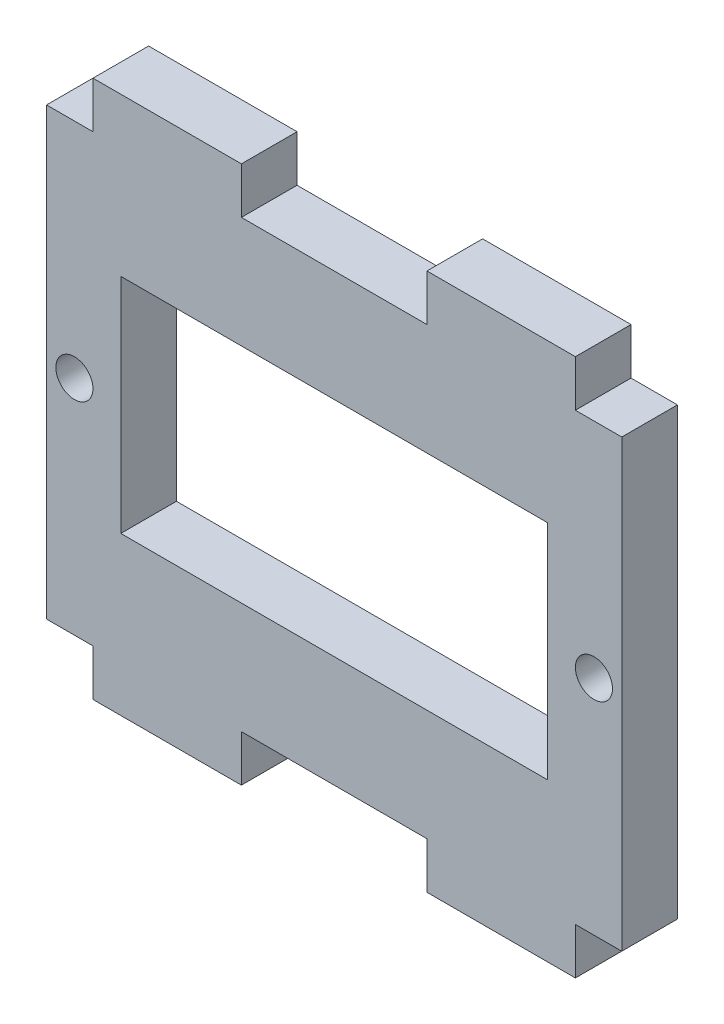
ISO-10303-21;
HEADER;
FILE_DESCRIPTION(('STEP AP214'),'2;1');
FILE_NAME('part.step','',(''),(''),'','','');
FILE_SCHEMA(('AUTOMOTIVE_DESIGN { 1 0 10303 214 1 1 1 1 }'));
ENDSEC;
DATA;
#1=APPLICATION_CONTEXT('core data for automotive mechanical design processes');
#2=APPLICATION_PROTOCOL_DEFINITION('international standard','automotive_design',2000,#1);
#3=PRODUCT_CONTEXT('',#1,'mechanical');
#4=PRODUCT('Part','Part','',(#3));
#5=PRODUCT_RELATED_PRODUCT_CATEGORY('part','',(#4));
#6=PRODUCT_DEFINITION_FORMATION('','',#4);
#7=PRODUCT_DEFINITION_CONTEXT('part definition',#1,'design');
#8=PRODUCT_DEFINITION('design','',#6,#7);
#9=PRODUCT_DEFINITION_SHAPE('','',#8);
#10=(LENGTH_UNIT() NAMED_UNIT(*) SI_UNIT(.MILLI.,.METRE.));
#11=(NAMED_UNIT(*) PLANE_ANGLE_UNIT() SI_UNIT($,.RADIAN.));
#12=(NAMED_UNIT(*) SI_UNIT($,.STERADIAN.) SOLID_ANGLE_UNIT());
#13=UNCERTAINTY_MEASURE_WITH_UNIT(LENGTH_MEASURE(1.E-05),#10,'distance_accuracy_value','');
#14=(GEOMETRIC_REPRESENTATION_CONTEXT(3) GLOBAL_UNCERTAINTY_ASSIGNED_CONTEXT((#13)) GLOBAL_UNIT_ASSIGNED_CONTEXT((#10,
#11,#12)) REPRESENTATION_CONTEXT('',''));
#15=CARTESIAN_POINT('',(0.,0.,0.));
#16=DIRECTION('',(0.,0.,1.));
#17=DIRECTION('',(1.,0.,0.));
#18=AXIS2_PLACEMENT_3D('',#15,#16,#17);
#19=CARTESIAN_POINT('',(15.5,0.,1.5));
#20=DIRECTION('',(1.,0.,0.));
#21=DIRECTION('',(0.,1.,0.));
#22=AXIS2_PLACEMENT_3D('',#19,#20,#21);
#23=PLANE('',#22);
#24=DIRECTION('',(0.,-1.,0.));
#25=VECTOR('',#24,1.);
#26=CARTESIAN_POINT('',(15.5,0.,-1.5));
#27=LINE('',#26,#25);
#28=CARTESIAN_POINT('',(15.5,12.,-1.5));
#29=VERTEX_POINT('',#28);
#30=CARTESIAN_POINT('',(15.5,-12.,-1.5));
#31=VERTEX_POINT('',#30);
#32=EDGE_CURVE('E254',#29,#31,#27,.T.);
#33=ORIENTED_EDGE('',*,*,#32,.F.);
#34=DIRECTION('',(0.,0.,-1.));
#35=VECTOR('',#34,1.);
#36=CARTESIAN_POINT('',(15.5,12.,1.5));
#37=LINE('',#36,#35);
#38=CARTESIAN_POINT('',(15.5,12.,1.5));
#39=VERTEX_POINT('',#38);
#40=EDGE_CURVE('E11',#39,#29,#37,.T.);
#41=ORIENTED_EDGE('',*,*,#40,.F.);
#42=DIRECTION('',(0.,-1.,0.));
#43=VECTOR('',#42,1.);
#44=CARTESIAN_POINT('',(15.5,0.,1.5));
#45=LINE('',#44,#43);
#46=CARTESIAN_POINT('',(15.5,-12.,1.5));
#47=VERTEX_POINT('',#46);
#48=EDGE_CURVE('E446',#39,#47,#45,.T.);
#49=ORIENTED_EDGE('',*,*,#48,.T.);
#50=DIRECTION('',(0.,0.,-1.));
#51=VECTOR('',#50,1.);
#52=CARTESIAN_POINT('',(15.5,-12.,1.5));
#53=LINE('',#52,#51);
#54=EDGE_CURVE('E137',#47,#31,#53,.T.);
#55=ORIENTED_EDGE('',*,*,#54,.T.);
#56=EDGE_LOOP('',(#33,#41,#49,#55));
#57=FACE_BOUND('',#56,.T.);
#58=ADVANCED_FACE('F35',(#57),#23,.T.);
#59=CARTESIAN_POINT('',(0.,12.,1.5));
#60=DIRECTION('',(0.,1.,0.));
#61=DIRECTION('',(0.,0.,1.));
#62=AXIS2_PLACEMENT_3D('',#59,#60,#61);
#63=PLANE('',#62);
#64=DIRECTION('',(1.,0.,0.));
#65=VECTOR('',#64,1.);
#66=CARTESIAN_POINT('',(0.,12.,-1.5));
#67=LINE('',#66,#65);
#68=CARTESIAN_POINT('',(13.,12.,-1.5));
#69=VERTEX_POINT('',#68);
#70=EDGE_CURVE('E256',#69,#29,#67,.T.);
#71=ORIENTED_EDGE('',*,*,#70,.F.);
#72=DIRECTION('',(0.,0.,-1.));
#73=VECTOR('',#72,1.);
#74=CARTESIAN_POINT('',(13.,12.,1.5));
#75=LINE('',#74,#73);
#76=CARTESIAN_POINT('',(13.,12.,1.5));
#77=VERTEX_POINT('',#76);
#78=EDGE_CURVE('E45',#77,#69,#75,.T.);
#79=ORIENTED_EDGE('',*,*,#78,.F.);
#80=DIRECTION('',(1.,0.,0.));
#81=VECTOR('',#80,1.);
#82=CARTESIAN_POINT('',(0.,12.,1.5));
#83=LINE('',#82,#81);
#84=EDGE_CURVE('E448',#77,#39,#83,.T.);
#85=ORIENTED_EDGE('',*,*,#84,.T.);
#86=ORIENTED_EDGE('',*,*,#40,.T.);
#87=EDGE_LOOP('',(#71,#79,#85,#86));
#88=FACE_BOUND('',#87,.T.);
#89=ADVANCED_FACE('F377',(#88),#63,.T.);
#90=CARTESIAN_POINT('',(13.,0.,1.5));
#91=DIRECTION('',(1.,0.,0.));
#92=DIRECTION('',(0.,1.,0.));
#93=AXIS2_PLACEMENT_3D('',#90,#91,#92);
#94=PLANE('',#93);
#95=DIRECTION('',(0.,-1.,0.));
#96=VECTOR('',#95,1.);
#97=CARTESIAN_POINT('',(13.,0.,-1.5));
#98=LINE('',#97,#96);
#99=CARTESIAN_POINT('',(13.,14.5,-1.5));
#100=VERTEX_POINT('',#99);
#101=EDGE_CURVE('E259',#100,#69,#98,.T.);
#102=ORIENTED_EDGE('',*,*,#101,.F.);
#103=DIRECTION('',(0.,0.,-1.));
#104=VECTOR('',#103,1.);
#105=CARTESIAN_POINT('',(13.,14.5,1.5));
#106=LINE('',#105,#104);
#107=CARTESIAN_POINT('',(13.,14.5,1.5));
#108=VERTEX_POINT('',#107);
#109=EDGE_CURVE('E341',#108,#100,#106,.T.);
#110=ORIENTED_EDGE('',*,*,#109,.F.);
#111=DIRECTION('',(0.,-1.,0.));
#112=VECTOR('',#111,1.);
#113=CARTESIAN_POINT('',(13.,0.,1.5));
#114=LINE('',#113,#112);
#115=EDGE_CURVE('E451',#108,#77,#114,.T.);
#116=ORIENTED_EDGE('',*,*,#115,.T.);
#117=ORIENTED_EDGE('',*,*,#78,.T.);
#118=EDGE_LOOP('',(#102,#110,#116,#117));
#119=FACE_BOUND('',#118,.T.);
#120=ADVANCED_FACE('F382',(#119),#94,.T.);
#121=CARTESIAN_POINT('',(0.,14.5,1.5));
#122=DIRECTION('',(0.,-1.,0.));
#123=DIRECTION('',(1.,0.,0.));
#124=AXIS2_PLACEMENT_3D('',#121,#122,#123);
#125=PLANE('',#124);
#126=DIRECTION('',(-1.,0.,0.));
#127=VECTOR('',#126,1.);
#128=CARTESIAN_POINT('',(0.,14.5,-1.5));
#129=LINE('',#128,#127);
#130=CARTESIAN_POINT('',(4.99999999999999,14.5,-1.5));
#131=VERTEX_POINT('',#130);
#132=EDGE_CURVE('E264',#100,#131,#129,.T.);
#133=ORIENTED_EDGE('',*,*,#132,.T.);
#134=DIRECTION('',(0.,0.,-1.));
#135=VECTOR('',#134,1.);
#136=CARTESIAN_POINT('',(4.99999999999999,14.5,1.5));
#137=LINE('',#136,#135);
#138=CARTESIAN_POINT('',(4.99999999999999,14.5,1.5));
#139=VERTEX_POINT('',#138);
#140=EDGE_CURVE('E338',#139,#131,#137,.T.);
#141=ORIENTED_EDGE('',*,*,#140,.F.);
#142=DIRECTION('',(-1.,0.,0.));
#143=VECTOR('',#142,1.);
#144=CARTESIAN_POINT('',(0.,14.5,1.5));
#145=LINE('',#144,#143);
#146=EDGE_CURVE('E456',#108,#139,#145,.T.);
#147=ORIENTED_EDGE('',*,*,#146,.F.);
#148=ORIENTED_EDGE('',*,*,#109,.T.);
#149=EDGE_LOOP('',(#133,#141,#147,#148));
#150=FACE_BOUND('',#149,.T.);
#151=ADVANCED_FACE('F512',(#150),#125,.F.);
#152=CARTESIAN_POINT('',(4.99999999999999,0.,1.5));
#153=DIRECTION('',(1.,0.,0.));
#154=DIRECTION('',(0.,0.,-1.));
#155=AXIS2_PLACEMENT_3D('',#152,#153,#154);
#156=PLANE('',#155);
#157=DIRECTION('',(0.,-1.,0.));
#158=VECTOR('',#157,1.);
#159=CARTESIAN_POINT('',(4.99999999999999,0.,-1.5));
#160=LINE('',#159,#158);
#161=CARTESIAN_POINT('',(4.99999999999999,12.,-1.5));
#162=VERTEX_POINT('',#161);
#163=EDGE_CURVE('E267',#131,#162,#160,.T.);
#164=ORIENTED_EDGE('',*,*,#163,.T.);
#165=DIRECTION('',(0.,0.,-1.));
#166=VECTOR('',#165,1.);
#167=CARTESIAN_POINT('',(4.99999999999999,12.,1.5));
#168=LINE('',#167,#166);
#169=CARTESIAN_POINT('',(4.99999999999999,12.,1.5));
#170=VERTEX_POINT('',#169);
#171=EDGE_CURVE('E336',#170,#162,#168,.T.);
#172=ORIENTED_EDGE('',*,*,#171,.F.);
#173=DIRECTION('',(0.,-1.,0.));
#174=VECTOR('',#173,1.);
#175=CARTESIAN_POINT('',(4.99999999999999,0.,1.5));
#176=LINE('',#175,#174);
#177=EDGE_CURVE('E459',#139,#170,#176,.T.);
#178=ORIENTED_EDGE('',*,*,#177,.F.);
#179=ORIENTED_EDGE('',*,*,#140,.T.);
#180=EDGE_LOOP('',(#164,#172,#178,#179));
#181=FACE_BOUND('',#180,.T.);
#182=ADVANCED_FACE('F508',(#181),#156,.F.);
#183=CARTESIAN_POINT('',(-5.,12.,-1.5));
#184=VERTEX_POINT('',#183);
#185=EDGE_CURVE('E261',#184,#162,#67,.T.);
#186=ORIENTED_EDGE('',*,*,#185,.F.);
#187=DIRECTION('',(0.,0.,-1.));
#188=VECTOR('',#187,1.);
#189=CARTESIAN_POINT('',(-5.,12.,1.5));
#190=LINE('',#189,#188);
#191=CARTESIAN_POINT('',(-5.,12.,1.5));
#192=VERTEX_POINT('',#191);
#193=EDGE_CURVE('E334',#192,#184,#190,.T.);
#194=ORIENTED_EDGE('',*,*,#193,.F.);
#195=EDGE_CURVE('E453',#192,#170,#83,.T.);
#196=ORIENTED_EDGE('',*,*,#195,.T.);
#197=ORIENTED_EDGE('',*,*,#171,.T.);
#198=EDGE_LOOP('',(#186,#194,#196,#197));
#199=FACE_BOUND('',#198,.T.);
#200=ADVANCED_FACE('F385',(#199),#63,.T.);
#201=CARTESIAN_POINT('',(-5.,0.,1.5));
#202=DIRECTION('',(1.,0.,0.));
#203=DIRECTION('',(0.,0.,-1.));
#204=AXIS2_PLACEMENT_3D('',#201,#202,#203);
#205=PLANE('',#204);
#206=DIRECTION('',(0.,-1.,0.));
#207=VECTOR('',#206,1.);
#208=CARTESIAN_POINT('',(-5.,0.,-1.5));
#209=LINE('',#208,#207);
#210=CARTESIAN_POINT('',(-5.,14.5,-1.5));
#211=VERTEX_POINT('',#210);
#212=EDGE_CURVE('E270',#211,#184,#209,.T.);
#213=ORIENTED_EDGE('',*,*,#212,.F.);
#214=DIRECTION('',(0.,0.,-1.));
#215=VECTOR('',#214,1.);
#216=CARTESIAN_POINT('',(-5.,14.5,1.5));
#217=LINE('',#216,#215);
#218=CARTESIAN_POINT('',(-5.,14.5,1.5));
#219=VERTEX_POINT('',#218);
#220=EDGE_CURVE('E332',#219,#211,#217,.T.);
#221=ORIENTED_EDGE('',*,*,#220,.F.);
#222=DIRECTION('',(0.,-1.,0.));
#223=VECTOR('',#222,1.);
#224=CARTESIAN_POINT('',(-5.,0.,1.5));
#225=LINE('',#224,#223);
#226=EDGE_CURVE('E461',#219,#192,#225,.T.);
#227=ORIENTED_EDGE('',*,*,#226,.T.);
#228=ORIENTED_EDGE('',*,*,#193,.T.);
#229=EDGE_LOOP('',(#213,#221,#227,#228));
#230=FACE_BOUND('',#229,.T.);
#231=ADVANCED_FACE('F521',(#230),#205,.T.);
#232=CARTESIAN_POINT('',(0.,14.5,1.5));
#233=DIRECTION('',(0.,1.,0.));
#234=DIRECTION('',(-1.,0.,0.));
#235=AXIS2_PLACEMENT_3D('',#232,#233,#234);
#236=PLANE('',#235);
#237=DIRECTION('',(1.,0.,0.));
#238=VECTOR('',#237,1.);
#239=CARTESIAN_POINT('',(0.,14.5,-1.5));
#240=LINE('',#239,#238);
#241=CARTESIAN_POINT('',(-13.,14.5,-1.5));
#242=VERTEX_POINT('',#241);
#243=EDGE_CURVE('E273',#242,#211,#240,.T.);
#244=ORIENTED_EDGE('',*,*,#243,.F.);
#245=DIRECTION('',(0.,0.,-1.));
#246=VECTOR('',#245,1.);
#247=CARTESIAN_POINT('',(-13.,14.5,1.5));
#248=LINE('',#247,#246);
#249=CARTESIAN_POINT('',(-13.,14.5,1.5));
#250=VERTEX_POINT('',#249);
#251=EDGE_CURVE('E330',#250,#242,#248,.T.);
#252=ORIENTED_EDGE('',*,*,#251,.F.);
#253=DIRECTION('',(1.,0.,0.));
#254=VECTOR('',#253,1.);
#255=CARTESIAN_POINT('',(0.,14.5,1.5));
#256=LINE('',#255,#254);
#257=EDGE_CURVE('E464',#250,#219,#256,.T.);
#258=ORIENTED_EDGE('',*,*,#257,.T.);
#259=ORIENTED_EDGE('',*,*,#220,.T.);
#260=EDGE_LOOP('',(#244,#252,#258,#259));
#261=FACE_BOUND('',#260,.T.);
#262=ADVANCED_FACE('F524',(#261),#236,.T.);
#263=CARTESIAN_POINT('',(-13.,0.,1.5));
#264=DIRECTION('',(1.,0.,0.));
#265=DIRECTION('',(0.,0.,-1.));
#266=AXIS2_PLACEMENT_3D('',#263,#264,#265);
#267=PLANE('',#266);
#268=DIRECTION('',(0.,-1.,0.));
#269=VECTOR('',#268,1.);
#270=CARTESIAN_POINT('',(-13.,0.,-1.5));
#271=LINE('',#270,#269);
#272=CARTESIAN_POINT('',(-13.,12.,-1.5));
#273=VERTEX_POINT('',#272);
#274=EDGE_CURVE('E276',#242,#273,#271,.T.);
#275=ORIENTED_EDGE('',*,*,#274,.T.);
#276=DIRECTION('',(0.,0.,-1.));
#277=VECTOR('',#276,1.);
#278=CARTESIAN_POINT('',(-13.,12.,1.5));
#279=LINE('',#278,#277);
#280=CARTESIAN_POINT('',(-13.,12.,1.5));
#281=VERTEX_POINT('',#280);
#282=EDGE_CURVE('E328',#281,#273,#279,.T.);
#283=ORIENTED_EDGE('',*,*,#282,.F.);
#284=DIRECTION('',(0.,-1.,0.));
#285=VECTOR('',#284,1.);
#286=CARTESIAN_POINT('',(-13.,0.,1.5));
#287=LINE('',#286,#285);
#288=EDGE_CURVE('E467',#250,#281,#287,.T.);
#289=ORIENTED_EDGE('',*,*,#288,.F.);
#290=ORIENTED_EDGE('',*,*,#251,.T.);
#291=EDGE_LOOP('',(#275,#283,#289,#290));
#292=FACE_BOUND('',#291,.T.);
#293=ADVANCED_FACE('F528',(#292),#267,.F.);
#294=CARTESIAN_POINT('',(-15.5,12.,-1.5));
#295=VERTEX_POINT('',#294);
#296=EDGE_CURVE('E260',#295,#273,#67,.T.);
#297=ORIENTED_EDGE('',*,*,#296,.F.);
#298=DIRECTION('',(0.,0.,-1.));
#299=VECTOR('',#298,1.);
#300=CARTESIAN_POINT('',(-15.5,12.,1.5));
#301=LINE('',#300,#299);
#302=CARTESIAN_POINT('',(-15.5,12.,1.5));
#303=VERTEX_POINT('',#302);
#304=EDGE_CURVE('E326',#303,#295,#301,.T.);
#305=ORIENTED_EDGE('',*,*,#304,.F.);
#306=EDGE_CURVE('E452',#303,#281,#83,.T.);
#307=ORIENTED_EDGE('',*,*,#306,.T.);
#308=ORIENTED_EDGE('',*,*,#282,.T.);
#309=EDGE_LOOP('',(#297,#305,#307,#308));
#310=FACE_BOUND('',#309,.T.);
#311=ADVANCED_FACE('F386',(#310),#63,.T.);
#312=CARTESIAN_POINT('',(-15.5,0.,1.5));
#313=DIRECTION('',(1.,0.,0.));
#314=DIRECTION('',(0.,1.,0.));
#315=AXIS2_PLACEMENT_3D('',#312,#313,#314);
#316=PLANE('',#315);
#317=DIRECTION('',(0.,-1.,0.));
#318=VECTOR('',#317,1.);
#319=CARTESIAN_POINT('',(-15.5,0.,-1.5));
#320=LINE('',#319,#318);
#321=CARTESIAN_POINT('',(-15.5,-12.,-1.5));
#322=VERTEX_POINT('',#321);
#323=EDGE_CURVE('E279',#295,#322,#320,.T.);
#324=ORIENTED_EDGE('',*,*,#323,.T.);
#325=DIRECTION('',(0.,0.,-1.));
#326=VECTOR('',#325,1.);
#327=CARTESIAN_POINT('',(-15.5,-12.,1.5));
#328=LINE('',#327,#326);
#329=CARTESIAN_POINT('',(-15.5,-12.,1.5));
#330=VERTEX_POINT('',#329);
#331=EDGE_CURVE('E323',#330,#322,#328,.T.);
#332=ORIENTED_EDGE('',*,*,#331,.F.);
#333=DIRECTION('',(0.,-1.,0.));
#334=VECTOR('',#333,1.);
#335=CARTESIAN_POINT('',(-15.5,0.,1.5));
#336=LINE('',#335,#334);
#337=EDGE_CURVE('E469',#303,#330,#336,.T.);
#338=ORIENTED_EDGE('',*,*,#337,.F.);
#339=ORIENTED_EDGE('',*,*,#304,.T.);
#340=EDGE_LOOP('',(#324,#332,#338,#339));
#341=FACE_BOUND('',#340,.T.);
#342=ADVANCED_FACE('F406',(#341),#316,.F.);
#343=CARTESIAN_POINT('',(0.,-12.,1.5));
#344=DIRECTION('',(0.,1.,0.));
#345=DIRECTION('',(-1.,0.,0.));
#346=AXIS2_PLACEMENT_3D('',#343,#344,#345);
#347=PLANE('',#346);
#348=DIRECTION('',(1.,0.,0.));
#349=VECTOR('',#348,1.);
#350=CARTESIAN_POINT('',(0.,-12.,-1.5));
#351=LINE('',#350,#349);
#352=CARTESIAN_POINT('',(-13.,-12.,-1.5));
#353=VERTEX_POINT('',#352);
#354=EDGE_CURVE('E282',#322,#353,#351,.T.);
#355=ORIENTED_EDGE('',*,*,#354,.T.);
#356=DIRECTION('',(0.,0.,-1.));
#357=VECTOR('',#356,1.);
#358=CARTESIAN_POINT('',(-13.,-12.,1.5));
#359=LINE('',#358,#357);
#360=CARTESIAN_POINT('',(-13.,-12.,1.5));
#361=VERTEX_POINT('',#360);
#362=EDGE_CURVE('E321',#361,#353,#359,.T.);
#363=ORIENTED_EDGE('',*,*,#362,.F.);
#364=DIRECTION('',(1.,0.,0.));
#365=VECTOR('',#364,1.);
#366=CARTESIAN_POINT('',(0.,-12.,1.5));
#367=LINE('',#366,#365);
#368=EDGE_CURVE('E472',#330,#361,#367,.T.);
#369=ORIENTED_EDGE('',*,*,#368,.F.);
#370=ORIENTED_EDGE('',*,*,#331,.T.);
#371=EDGE_LOOP('',(#355,#363,#369,#370));
#372=FACE_BOUND('',#371,.T.);
#373=ADVANCED_FACE('F399',(#372),#347,.F.);
#374=CARTESIAN_POINT('',(-13.,0.,1.5));
#375=DIRECTION('',(-1.,0.,0.));
#376=DIRECTION('',(0.,-1.,0.));
#377=AXIS2_PLACEMENT_3D('',#374,#375,#376);
#378=PLANE('',#377);
#379=DIRECTION('',(0.,1.,0.));
#380=VECTOR('',#379,1.);
#381=CARTESIAN_POINT('',(-13.,0.,-1.5));
#382=LINE('',#381,#380);
#383=CARTESIAN_POINT('',(-13.,-14.5,-1.5));
#384=VERTEX_POINT('',#383);
#385=EDGE_CURVE('E285',#384,#353,#382,.T.);
#386=ORIENTED_EDGE('',*,*,#385,.F.);
#387=DIRECTION('',(0.,0.,-1.));
#388=VECTOR('',#387,1.);
#389=CARTESIAN_POINT('',(-13.,-14.5,1.5));
#390=LINE('',#389,#388);
#391=CARTESIAN_POINT('',(-13.,-14.5,1.5));
#392=VERTEX_POINT('',#391);
#393=EDGE_CURVE('E319',#392,#384,#390,.T.);
#394=ORIENTED_EDGE('',*,*,#393,.F.);
#395=DIRECTION('',(0.,1.,0.));
#396=VECTOR('',#395,1.);
#397=CARTESIAN_POINT('',(-13.,0.,1.5));
#398=LINE('',#397,#396);
#399=EDGE_CURVE('E474',#392,#361,#398,.T.);
#400=ORIENTED_EDGE('',*,*,#399,.T.);
#401=ORIENTED_EDGE('',*,*,#362,.T.);
#402=EDGE_LOOP('',(#386,#394,#400,#401));
#403=FACE_BOUND('',#402,.T.);
#404=ADVANCED_FACE('F405',(#403),#378,.T.);
#405=CARTESIAN_POINT('',(0.,-14.5,1.5));
#406=DIRECTION('',(0.,1.,0.));
#407=DIRECTION('',(-1.,0.,0.));
#408=AXIS2_PLACEMENT_3D('',#405,#406,#407);
#409=PLANE('',#408);
#410=DIRECTION('',(1.,0.,0.));
#411=VECTOR('',#410,1.);
#412=CARTESIAN_POINT('',(0.,-14.5,-1.5));
#413=LINE('',#412,#411);
#414=CARTESIAN_POINT('',(-4.99999999999999,-14.5,-1.5));
#415=VERTEX_POINT('',#414);
#416=EDGE_CURVE('E289',#384,#415,#413,.T.);
#417=ORIENTED_EDGE('',*,*,#416,.T.);
#418=DIRECTION('',(0.,0.,-1.));
#419=VECTOR('',#418,1.);
#420=CARTESIAN_POINT('',(-4.99999999999999,-14.5,1.5));
#421=LINE('',#420,#419);
#422=CARTESIAN_POINT('',(-4.99999999999999,-14.5,1.5));
#423=VERTEX_POINT('',#422);
#424=EDGE_CURVE('E316',#423,#415,#421,.T.);
#425=ORIENTED_EDGE('',*,*,#424,.F.);
#426=DIRECTION('',(1.,0.,0.));
#427=VECTOR('',#426,1.);
#428=CARTESIAN_POINT('',(0.,-14.5,1.5));
#429=LINE('',#428,#427);
#430=EDGE_CURVE('E477',#392,#423,#429,.T.);
#431=ORIENTED_EDGE('',*,*,#430,.F.);
#432=ORIENTED_EDGE('',*,*,#393,.T.);
#433=EDGE_LOOP('',(#417,#425,#431,#432));
#434=FACE_BOUND('',#433,.T.);
#435=ADVANCED_FACE('F418',(#434),#409,.F.);
#436=CARTESIAN_POINT('',(-4.99999999999999,0.,1.5));
#437=DIRECTION('',(-1.,0.,0.));
#438=DIRECTION('',(0.,-1.,0.));
#439=AXIS2_PLACEMENT_3D('',#436,#437,#438);
#440=PLANE('',#439);
#441=DIRECTION('',(0.,1.,0.));
#442=VECTOR('',#441,1.);
#443=CARTESIAN_POINT('',(-4.99999999999999,0.,-1.5));
#444=LINE('',#443,#442);
#445=CARTESIAN_POINT('',(-4.99999999999999,-12.,-1.5));
#446=VERTEX_POINT('',#445);
#447=EDGE_CURVE('E292',#415,#446,#444,.T.);
#448=ORIENTED_EDGE('',*,*,#447,.T.);
#449=DIRECTION('',(0.,0.,-1.));
#450=VECTOR('',#449,1.);
#451=CARTESIAN_POINT('',(-4.99999999999999,-12.,1.5));
#452=LINE('',#451,#450);
#453=CARTESIAN_POINT('',(-4.99999999999999,-12.,1.5));
#454=VERTEX_POINT('',#453);
#455=EDGE_CURVE('E313',#454,#446,#452,.T.);
#456=ORIENTED_EDGE('',*,*,#455,.F.);
#457=DIRECTION('',(0.,1.,0.));
#458=VECTOR('',#457,1.);
#459=CARTESIAN_POINT('',(-4.99999999999999,0.,1.5));
#460=LINE('',#459,#458);
#461=EDGE_CURVE('E479',#423,#454,#460,.T.);
#462=ORIENTED_EDGE('',*,*,#461,.F.);
#463=ORIENTED_EDGE('',*,*,#424,.T.);
#464=EDGE_LOOP('',(#448,#456,#462,#463));
#465=FACE_BOUND('',#464,.T.);
#466=ADVANCED_FACE('F410',(#465),#440,.F.);
#467=CARTESIAN_POINT('',(5.,-12.,-1.5));
#468=VERTEX_POINT('',#467);
#469=EDGE_CURVE('E286',#446,#468,#351,.T.);
#470=ORIENTED_EDGE('',*,*,#469,.T.);
#471=DIRECTION('',(0.,0.,-1.));
#472=VECTOR('',#471,1.);
#473=CARTESIAN_POINT('',(5.,-12.,1.5));
#474=LINE('',#473,#472);
#475=CARTESIAN_POINT('',(5.,-12.,1.5));
#476=VERTEX_POINT('',#475);
#477=EDGE_CURVE('E311',#476,#468,#474,.T.);
#478=ORIENTED_EDGE('',*,*,#477,.F.);
#479=EDGE_CURVE('E231',#454,#476,#367,.T.);
#480=ORIENTED_EDGE('',*,*,#479,.F.);
#481=ORIENTED_EDGE('',*,*,#455,.T.);
#482=EDGE_LOOP('',(#470,#478,#480,#481));
#483=FACE_BOUND('',#482,.T.);
#484=ADVANCED_FACE('F400',(#483),#347,.F.);
#485=CARTESIAN_POINT('',(4.99999999999999,0.,1.5));
#486=DIRECTION('',(-1.,0.,0.));
#487=DIRECTION('',(0.,-1.,0.));
#488=AXIS2_PLACEMENT_3D('',#485,#486,#487);
#489=PLANE('',#488);
#490=DIRECTION('',(0.,1.,0.));
#491=VECTOR('',#490,1.);
#492=CARTESIAN_POINT('',(4.99999999999999,0.,-1.5));
#493=LINE('',#492,#491);
#494=CARTESIAN_POINT('',(5.,-14.5,-1.5));
#495=VERTEX_POINT('',#494);
#496=EDGE_CURVE('E295',#495,#468,#493,.T.);
#497=ORIENTED_EDGE('',*,*,#496,.F.);
#498=DIRECTION('',(0.,0.,-1.));
#499=VECTOR('',#498,1.);
#500=CARTESIAN_POINT('',(5.,-14.5,1.5));
#501=LINE('',#500,#499);
#502=CARTESIAN_POINT('',(5.,-14.5,1.5));
#503=VERTEX_POINT('',#502);
#504=EDGE_CURVE('E218',#503,#495,#501,.T.);
#505=ORIENTED_EDGE('',*,*,#504,.F.);
#506=DIRECTION('',(0.,1.,0.));
#507=VECTOR('',#506,1.);
#508=CARTESIAN_POINT('',(4.99999999999999,0.,1.5));
#509=LINE('',#508,#507);
#510=EDGE_CURVE('E229',#503,#476,#509,.T.);
#511=ORIENTED_EDGE('',*,*,#510,.T.);
#512=ORIENTED_EDGE('',*,*,#477,.T.);
#513=EDGE_LOOP('',(#497,#505,#511,#512));
#514=FACE_BOUND('',#513,.T.);
#515=ADVANCED_FACE('F409',(#514),#489,.T.);
#516=CARTESIAN_POINT('',(0.,-14.5,1.5));
#517=DIRECTION('',(0.,-1.,0.));
#518=DIRECTION('',(0.,0.,-1.));
#519=AXIS2_PLACEMENT_3D('',#516,#517,#518);
#520=PLANE('',#519);
#521=DIRECTION('',(-1.,0.,0.));
#522=VECTOR('',#521,1.);
#523=CARTESIAN_POINT('',(0.,-14.5,-1.5));
#524=LINE('',#523,#522);
#525=CARTESIAN_POINT('',(13.,-14.5,-1.5));
#526=VERTEX_POINT('',#525);
#527=EDGE_CURVE('E215',#526,#495,#524,.T.);
#528=ORIENTED_EDGE('',*,*,#527,.F.);
#529=DIRECTION('',(0.,0.,-1.));
#530=VECTOR('',#529,1.);
#531=CARTESIAN_POINT('',(13.,-14.5,1.5));
#532=LINE('',#531,#530);
#533=CARTESIAN_POINT('',(13.,-14.5,1.5));
#534=VERTEX_POINT('',#533);
#535=EDGE_CURVE('E209',#534,#526,#532,.T.);
#536=ORIENTED_EDGE('',*,*,#535,.F.);
#537=DIRECTION('',(-1.,0.,0.));
#538=VECTOR('',#537,1.);
#539=CARTESIAN_POINT('',(0.,-14.5,1.5));
#540=LINE('',#539,#538);
#541=EDGE_CURVE('E213',#534,#503,#540,.T.);
#542=ORIENTED_EDGE('',*,*,#541,.T.);
#543=ORIENTED_EDGE('',*,*,#504,.T.);
#544=EDGE_LOOP('',(#528,#536,#542,#543));
#545=FACE_BOUND('',#544,.T.);
#546=ADVANCED_FACE('F211',(#545),#520,.T.);
#547=CARTESIAN_POINT('',(13.,0.,1.5));
#548=DIRECTION('',(-1.,0.,0.));
#549=DIRECTION('',(0.,-1.,0.));
#550=AXIS2_PLACEMENT_3D('',#547,#548,#549);
#551=PLANE('',#550);
#552=DIRECTION('',(0.,1.,0.));
#553=VECTOR('',#552,1.);
#554=CARTESIAN_POINT('',(13.,0.,-1.5));
#555=LINE('',#554,#553);
#556=CARTESIAN_POINT('',(13.,-12.,-1.5));
#557=VERTEX_POINT('',#556);
#558=EDGE_CURVE('E299',#526,#557,#555,.T.);
#559=ORIENTED_EDGE('',*,*,#558,.T.);
#560=DIRECTION('',(0.,0.,-1.));
#561=VECTOR('',#560,1.);
#562=CARTESIAN_POINT('',(13.,-12.,1.5));
#563=LINE('',#562,#561);
#564=CARTESIAN_POINT('',(13.,-12.,1.5));
#565=VERTEX_POINT('',#564);
#566=EDGE_CURVE('E219',#565,#557,#563,.T.);
#567=ORIENTED_EDGE('',*,*,#566,.F.);
#568=DIRECTION('',(0.,1.,0.));
#569=VECTOR('',#568,1.);
#570=CARTESIAN_POINT('',(13.,0.,1.5));
#571=LINE('',#570,#569);
#572=EDGE_CURVE('E222',#534,#565,#571,.T.);
#573=ORIENTED_EDGE('',*,*,#572,.F.);
#574=ORIENTED_EDGE('',*,*,#535,.T.);
#575=EDGE_LOOP('',(#559,#567,#573,#574));
#576=FACE_BOUND('',#575,.T.);
#577=ADVANCED_FACE('F223',(#576),#551,.F.);
#578=CARTESIAN_POINT('',(0.,6.00000000000001,1.5));
#579=DIRECTION('',(0.,1.,0.));
#580=DIRECTION('',(-1.,0.,0.));
#581=AXIS2_PLACEMENT_3D('',#578,#579,#580);
#582=PLANE('',#581);
#583=DIRECTION('',(1.,0.,0.));
#584=VECTOR('',#583,1.);
#585=CARTESIAN_POINT('',(0.,6.00000000000001,-1.5));
#586=LINE('',#585,#584);
#587=CARTESIAN_POINT('',(-11.5,6.,-1.5));
#588=VERTEX_POINT('',#587);
#589=CARTESIAN_POINT('',(11.5,6.00000000000001,-1.5));
#590=VERTEX_POINT('',#589);
#591=EDGE_CURVE('E242',#588,#590,#586,.T.);
#592=ORIENTED_EDGE('',*,*,#591,.T.);
#593=DIRECTION('',(0.,0.,-1.));
#594=VECTOR('',#593,1.);
#595=CARTESIAN_POINT('',(11.5,6.00000000000001,1.5));
#596=LINE('',#595,#594);
#597=CARTESIAN_POINT('',(11.5,6.00000000000001,1.5));
#598=VERTEX_POINT('',#597);
#599=EDGE_CURVE('E39',#598,#590,#596,.T.);
#600=ORIENTED_EDGE('',*,*,#599,.F.);
#601=DIRECTION('',(1.,0.,0.));
#602=VECTOR('',#601,1.);
#603=CARTESIAN_POINT('',(0.,6.00000000000001,1.5));
#604=LINE('',#603,#602);
#605=CARTESIAN_POINT('',(-11.5,6.,1.5));
#606=VERTEX_POINT('',#605);
#607=EDGE_CURVE('E307',#606,#598,#604,.T.);
#608=ORIENTED_EDGE('',*,*,#607,.F.);
#609=DIRECTION('',(0.,0.,-1.));
#610=VECTOR('',#609,1.);
#611=CARTESIAN_POINT('',(-11.5,6.,1.5));
#612=LINE('',#611,#610);
#613=EDGE_CURVE('E241',#606,#588,#612,.T.);
#614=ORIENTED_EDGE('',*,*,#613,.T.);
#615=EDGE_LOOP('',(#592,#600,#608,#614));
#616=FACE_BOUND('',#615,.T.);
#617=ADVANCED_FACE('F37',(#616),#582,.F.);
#618=CARTESIAN_POINT('',(11.5,0.,1.5));
#619=DIRECTION('',(1.,0.,0.));
#620=DIRECTION('',(0.,0.,-1.));
#621=AXIS2_PLACEMENT_3D('',#618,#619,#620);
#622=PLANE('',#621);
#623=DIRECTION('',(0.,-1.,0.));
#624=VECTOR('',#623,1.);
#625=CARTESIAN_POINT('',(11.5,0.,-1.5));
#626=LINE('',#625,#624);
#627=CARTESIAN_POINT('',(11.5,-6.00000000000001,-1.5));
#628=VERTEX_POINT('',#627);
#629=EDGE_CURVE('E245',#590,#628,#626,.T.);
#630=ORIENTED_EDGE('',*,*,#629,.T.);
#631=DIRECTION('',(0.,0.,-1.));
#632=VECTOR('',#631,1.);
#633=CARTESIAN_POINT('',(11.5,-6.00000000000001,1.5));
#634=LINE('',#633,#632);
#635=CARTESIAN_POINT('',(11.5,-6.00000000000001,1.5));
#636=VERTEX_POINT('',#635);
#637=EDGE_CURVE('E346',#636,#628,#634,.T.);
#638=ORIENTED_EDGE('',*,*,#637,.F.);
#639=DIRECTION('',(0.,-1.,0.));
#640=VECTOR('',#639,1.);
#641=CARTESIAN_POINT('',(11.5,0.,1.5));
#642=LINE('',#641,#640);
#643=EDGE_CURVE('E145',#598,#636,#642,.T.);
#644=ORIENTED_EDGE('',*,*,#643,.F.);
#645=ORIENTED_EDGE('',*,*,#599,.T.);
#646=EDGE_LOOP('',(#630,#638,#644,#645));
#647=FACE_BOUND('',#646,.T.);
#648=ADVANCED_FACE('F351',(#647),#622,.F.);
#649=CARTESIAN_POINT('',(0.,-6.,1.5));
#650=DIRECTION('',(0.,1.,0.));
#651=DIRECTION('',(-1.,0.,0.));
#652=AXIS2_PLACEMENT_3D('',#649,#650,#651);
#653=PLANE('',#652);
#654=DIRECTION('',(1.,0.,0.));
#655=VECTOR('',#654,1.);
#656=CARTESIAN_POINT('',(0.,-6.,-1.5));
#657=LINE('',#656,#655);
#658=CARTESIAN_POINT('',(-11.5,-6.,-1.5));
#659=VERTEX_POINT('',#658);
#660=EDGE_CURVE('E248',#659,#628,#657,.T.);
#661=ORIENTED_EDGE('',*,*,#660,.F.);
#662=DIRECTION('',(0.,0.,-1.));
#663=VECTOR('',#662,1.);
#664=CARTESIAN_POINT('',(-11.5,-6.,1.5));
#665=LINE('',#664,#663);
#666=CARTESIAN_POINT('',(-11.5,-6.,1.5));
#667=VERTEX_POINT('',#666);
#668=EDGE_CURVE('E345',#667,#659,#665,.T.);
#669=ORIENTED_EDGE('',*,*,#668,.F.);
#670=DIRECTION('',(1.,0.,0.));
#671=VECTOR('',#670,1.);
#672=CARTESIAN_POINT('',(0.,-6.,1.5));
#673=LINE('',#672,#671);
#674=EDGE_CURVE('E441',#667,#636,#673,.T.);
#675=ORIENTED_EDGE('',*,*,#674,.T.);
#676=ORIENTED_EDGE('',*,*,#637,.T.);
#677=EDGE_LOOP('',(#661,#669,#675,#676));
#678=FACE_BOUND('',#677,.T.);
#679=ADVANCED_FACE('F364',(#678),#653,.T.);
#680=CARTESIAN_POINT('',(-14.,0.,1.5));
#681=DIRECTION('',(0.,0.,-1.));
#682=DIRECTION('',(-1.,0.,0.));
#683=AXIS2_PLACEMENT_3D('',#680,#681,#682);
#684=CYLINDRICAL_SURFACE('',#683,1.);
#685=CARTESIAN_POINT('',(-14.,0.,1.5));
#686=DIRECTION('',(0.,0.,1.));
#687=DIRECTION('',(1.,0.,0.));
#688=AXIS2_PLACEMENT_3D('',#685,#686,#687);
#689=CIRCLE('',#688,1.);
#690=CARTESIAN_POINT('',(-13.,0.,1.5));
#691=VERTEX_POINT('',#690);
#692=EDGE_CURVE('E235',#691,#691,#689,.T.);
#693=ORIENTED_EDGE('',*,*,#692,.T.);
#694=EDGE_LOOP('',(#693));
#695=FACE_BOUND('',#694,.T.);
#696=CARTESIAN_POINT('',(-14.,0.,-1.5));
#697=DIRECTION('',(0.,0.,1.));
#698=DIRECTION('',(1.,0.,0.));
#699=AXIS2_PLACEMENT_3D('',#696,#697,#698);
#700=CIRCLE('',#699,1.);
#701=CARTESIAN_POINT('',(-13.,0.,-1.5));
#702=VERTEX_POINT('',#701);
#703=EDGE_CURVE('E301',#702,#702,#700,.T.);
#704=ORIENTED_EDGE('',*,*,#703,.F.);
#705=EDGE_LOOP('',(#704));
#706=FACE_BOUND('',#705,.T.);
#707=ADVANCED_FACE('F366',(#695,#706),#684,.F.);
#708=EDGE_CURVE('E130',#557,#31,#351,.T.);
#709=ORIENTED_EDGE('',*,*,#708,.T.);
#710=ORIENTED_EDGE('',*,*,#54,.F.);
#711=EDGE_CURVE('E54',#565,#47,#367,.T.);
#712=ORIENTED_EDGE('',*,*,#711,.F.);
#713=ORIENTED_EDGE('',*,*,#566,.T.);
#714=EDGE_LOOP('',(#709,#710,#712,#713));
#715=FACE_BOUND('',#714,.T.);
#716=ADVANCED_FACE('F372',(#715),#347,.F.);
#717=CARTESIAN_POINT('',(-11.5,0.,1.5));
#718=DIRECTION('',(1.,0.,0.));
#719=DIRECTION('',(0.,1.,0.));
#720=AXIS2_PLACEMENT_3D('',#717,#718,#719);
#721=PLANE('',#720);
#722=DIRECTION('',(0.,-1.,0.));
#723=VECTOR('',#722,1.);
#724=CARTESIAN_POINT('',(-11.5,0.,-1.5));
#725=LINE('',#724,#723);
#726=EDGE_CURVE('E251',#588,#659,#725,.T.);
#727=ORIENTED_EDGE('',*,*,#726,.F.);
#728=ORIENTED_EDGE('',*,*,#613,.F.);
#729=DIRECTION('',(0.,-1.,0.));
#730=VECTOR('',#729,1.);
#731=CARTESIAN_POINT('',(-11.5,0.,1.5));
#732=LINE('',#731,#730);
#733=EDGE_CURVE('E362',#606,#667,#732,.T.);
#734=ORIENTED_EDGE('',*,*,#733,.T.);
#735=ORIENTED_EDGE('',*,*,#668,.T.);
#736=EDGE_LOOP('',(#727,#728,#734,#735));
#737=FACE_BOUND('',#736,.T.);
#738=ADVANCED_FACE('F359',(#737),#721,.T.);
#739=CARTESIAN_POINT('',(14.,0.,1.5));
#740=DIRECTION('',(0.,0.,-1.));
#741=DIRECTION('',(-1.,0.,0.));
#742=AXIS2_PLACEMENT_3D('',#739,#740,#741);
#743=CYLINDRICAL_SURFACE('',#742,1.);
#744=CARTESIAN_POINT('',(14.,0.,1.5));
#745=DIRECTION('',(0.,0.,1.));
#746=DIRECTION('',(1.,0.,0.));
#747=AXIS2_PLACEMENT_3D('',#744,#745,#746);
#748=CIRCLE('',#747,1.);
#749=CARTESIAN_POINT('',(15.,0.,1.5));
#750=VERTEX_POINT('',#749);
#751=EDGE_CURVE('E238',#750,#750,#748,.F.);
#752=ORIENTED_EDGE('',*,*,#751,.F.);
#753=EDGE_LOOP('',(#752));
#754=FACE_BOUND('',#753,.T.);
#755=CARTESIAN_POINT('',(14.,0.,-1.5));
#756=DIRECTION('',(0.,0.,1.));
#757=DIRECTION('',(1.,0.,0.));
#758=AXIS2_PLACEMENT_3D('',#755,#756,#757);
#759=CIRCLE('',#758,1.);
#760=CARTESIAN_POINT('',(15.,0.,-1.5));
#761=VERTEX_POINT('',#760);
#762=EDGE_CURVE('E304',#761,#761,#759,.F.);
#763=ORIENTED_EDGE('',*,*,#762,.T.);
#764=EDGE_LOOP('',(#763));
#765=FACE_BOUND('',#764,.T.);
#766=ADVANCED_FACE('F390',(#754,#765),#743,.F.);
#767=CARTESIAN_POINT('',(0.,0.,1.5));
#768=DIRECTION('',(0.,0.,1.));
#769=DIRECTION('',(1.,0.,0.));
#770=AXIS2_PLACEMENT_3D('',#767,#768,#769);
#771=PLANE('',#770);
#772=ORIENTED_EDGE('',*,*,#607,.T.);
#773=ORIENTED_EDGE('',*,*,#643,.T.);
#774=ORIENTED_EDGE('',*,*,#674,.F.);
#775=ORIENTED_EDGE('',*,*,#733,.F.);
#776=EDGE_LOOP('',(#772,#773,#774,#775));
#777=FACE_BOUND('',#776,.T.);
#778=ORIENTED_EDGE('',*,*,#48,.F.);
#779=ORIENTED_EDGE('',*,*,#84,.F.);
#780=ORIENTED_EDGE('',*,*,#115,.F.);
#781=ORIENTED_EDGE('',*,*,#146,.T.);
#782=ORIENTED_EDGE('',*,*,#177,.T.);
#783=ORIENTED_EDGE('',*,*,#195,.F.);
#784=ORIENTED_EDGE('',*,*,#226,.F.);
#785=ORIENTED_EDGE('',*,*,#257,.F.);
#786=ORIENTED_EDGE('',*,*,#288,.T.);
#787=ORIENTED_EDGE('',*,*,#306,.F.);
#788=ORIENTED_EDGE('',*,*,#337,.T.);
#789=ORIENTED_EDGE('',*,*,#368,.T.);
#790=ORIENTED_EDGE('',*,*,#399,.F.);
#791=ORIENTED_EDGE('',*,*,#430,.T.);
#792=ORIENTED_EDGE('',*,*,#461,.T.);
#793=ORIENTED_EDGE('',*,*,#479,.T.);
#794=ORIENTED_EDGE('',*,*,#510,.F.);
#795=ORIENTED_EDGE('',*,*,#541,.F.);
#796=ORIENTED_EDGE('',*,*,#572,.T.);
#797=ORIENTED_EDGE('',*,*,#711,.T.);
#798=EDGE_LOOP('',(#778,#779,#780,#781,#782,#783,#784,#785,#786,#787,#788,#789,#790,#791,#792,
#793,#794,#795,#796,#797));
#799=FACE_BOUND('',#798,.T.);
#800=ORIENTED_EDGE('',*,*,#692,.F.);
#801=EDGE_LOOP('',(#800));
#802=FACE_BOUND('',#801,.T.);
#803=ORIENTED_EDGE('',*,*,#751,.T.);
#804=EDGE_LOOP('',(#803));
#805=FACE_BOUND('',#804,.T.);
#806=ADVANCED_FACE('F226',(#777,#799,#802,#805),#771,.T.);
#807=CARTESIAN_POINT('',(0.,0.,-1.5));
#808=DIRECTION('',(0.,0.,1.));
#809=DIRECTION('',(1.,0.,0.));
#810=AXIS2_PLACEMENT_3D('',#807,#808,#809);
#811=PLANE('',#810);
#812=ORIENTED_EDGE('',*,*,#591,.F.);
#813=ORIENTED_EDGE('',*,*,#726,.T.);
#814=ORIENTED_EDGE('',*,*,#660,.T.);
#815=ORIENTED_EDGE('',*,*,#629,.F.);
#816=EDGE_LOOP('',(#812,#813,#814,#815));
#817=FACE_BOUND('',#816,.T.);
#818=ORIENTED_EDGE('',*,*,#32,.T.);
#819=ORIENTED_EDGE('',*,*,#708,.F.);
#820=ORIENTED_EDGE('',*,*,#558,.F.);
#821=ORIENTED_EDGE('',*,*,#527,.T.);
#822=ORIENTED_EDGE('',*,*,#496,.T.);
#823=ORIENTED_EDGE('',*,*,#469,.F.);
#824=ORIENTED_EDGE('',*,*,#447,.F.);
#825=ORIENTED_EDGE('',*,*,#416,.F.);
#826=ORIENTED_EDGE('',*,*,#385,.T.);
#827=ORIENTED_EDGE('',*,*,#354,.F.);
#828=ORIENTED_EDGE('',*,*,#323,.F.);
#829=ORIENTED_EDGE('',*,*,#296,.T.);
#830=ORIENTED_EDGE('',*,*,#274,.F.);
#831=ORIENTED_EDGE('',*,*,#243,.T.);
#832=ORIENTED_EDGE('',*,*,#212,.T.);
#833=ORIENTED_EDGE('',*,*,#185,.T.);
#834=ORIENTED_EDGE('',*,*,#163,.F.);
#835=ORIENTED_EDGE('',*,*,#132,.F.);
#836=ORIENTED_EDGE('',*,*,#101,.T.);
#837=ORIENTED_EDGE('',*,*,#70,.T.);
#838=EDGE_LOOP('',(#818,#819,#820,#821,#822,#823,#824,#825,#826,#827,#828,#829,#830,#831,#832,
#833,#834,#835,#836,#837));
#839=FACE_BOUND('',#838,.T.);
#840=ORIENTED_EDGE('',*,*,#703,.T.);
#841=EDGE_LOOP('',(#840));
#842=FACE_BOUND('',#841,.T.);
#843=ORIENTED_EDGE('',*,*,#762,.F.);
#844=EDGE_LOOP('',(#843));
#845=FACE_BOUND('',#844,.T.);
#846=ADVANCED_FACE('F357',(#817,#839,#842,#845),#811,.F.);
#847=CLOSED_SHELL('',(#58,#89,#120,#151,#182,#200,#231,#262,#293,#311,#342,#373,#404,#435,#466,
#484,#515,#546,#577,#617,#648,#679,#707,#716,#738,#766,#806,#846));
#848=MANIFOLD_SOLID_BREP('B2',#847);
#849=ADVANCED_BREP_SHAPE_REPRESENTATION('',(#18,#848),#14);
#850=SHAPE_DEFINITION_REPRESENTATION(#9,#849);
ENDSEC;
END-ISO-10303-21;
